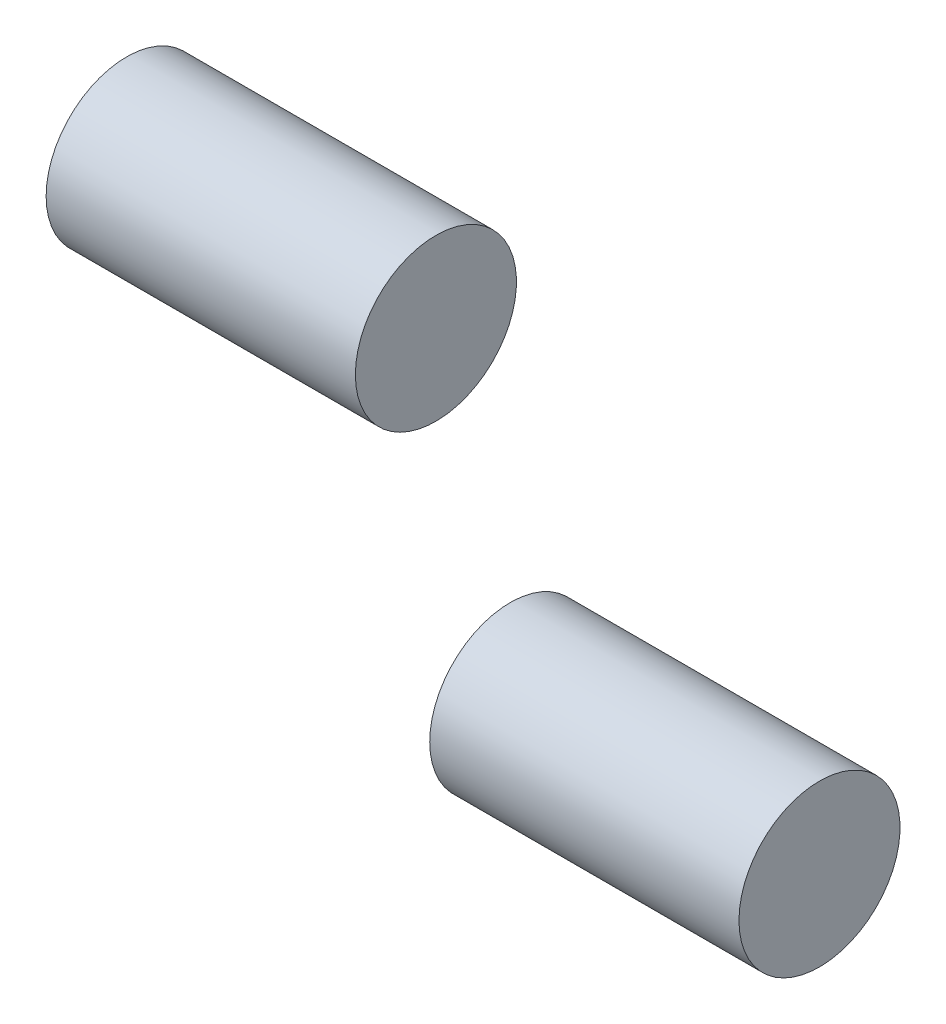
ISO-10303-21;
HEADER;
FILE_DESCRIPTION(('STEP AP214'),'2;1');
FILE_NAME('part.step','',(''),(''),'','','');
FILE_SCHEMA(('AUTOMOTIVE_DESIGN { 1 0 10303 214 1 1 1 1 }'));
ENDSEC;
DATA;
#1=APPLICATION_CONTEXT('core data for automotive mechanical design processes');
#2=APPLICATION_PROTOCOL_DEFINITION('international standard','automotive_design',2000,#1);
#3=PRODUCT_CONTEXT('',#1,'mechanical');
#4=PRODUCT('Part','Part','',(#3));
#5=PRODUCT_RELATED_PRODUCT_CATEGORY('part','',(#4));
#6=PRODUCT_DEFINITION_FORMATION('','',#4);
#7=PRODUCT_DEFINITION_CONTEXT('part definition',#1,'design');
#8=PRODUCT_DEFINITION('design','',#6,#7);
#9=PRODUCT_DEFINITION_SHAPE('','',#8);
#10=(LENGTH_UNIT() NAMED_UNIT(*) SI_UNIT(.MILLI.,.METRE.));
#11=(NAMED_UNIT(*) PLANE_ANGLE_UNIT() SI_UNIT($,.RADIAN.));
#12=(NAMED_UNIT(*) SI_UNIT($,.STERADIAN.) SOLID_ANGLE_UNIT());
#13=UNCERTAINTY_MEASURE_WITH_UNIT(LENGTH_MEASURE(1.E-05),#10,'distance_accuracy_value','');
#14=(GEOMETRIC_REPRESENTATION_CONTEXT(3) GLOBAL_UNCERTAINTY_ASSIGNED_CONTEXT((#13)) GLOBAL_UNIT_ASSIGNED_CONTEXT((#10,
#11,#12)) REPRESENTATION_CONTEXT('',''));
#15=CARTESIAN_POINT('',(0.,0.,0.));
#16=DIRECTION('',(0.,0.,1.));
#17=DIRECTION('',(1.,0.,0.));
#18=AXIS2_PLACEMENT_3D('',#15,#16,#17);
#19=CARTESIAN_POINT('',(9.94,5.49999999999999,2.27081684706087E-06));
#20=DIRECTION('',(1.,0.,0.));
#21=DIRECTION('',(0.,0.,-1.));
#22=AXIS2_PLACEMENT_3D('',#19,#20,#21);
#23=PLANE('',#22);
#24=CARTESIAN_POINT('',(9.94,5.5,0.));
#25=DIRECTION('',(-1.,0.,0.));
#26=DIRECTION('',(0.,0.,1.));
#27=AXIS2_PLACEMENT_3D('',#24,#25,#26);
#28=CIRCLE('',#27,1.);
#29=CARTESIAN_POINT('',(9.94,5.5,1.));
#30=VERTEX_POINT('',#29);
#31=EDGE_CURVE('P0_E17',#30,#30,#28,.T.);
#32=ORIENTED_EDGE('',*,*,#31,.F.);
#33=EDGE_LOOP('',(#32));
#34=FACE_BOUND('',#33,.T.);
#35=ADVANCED_FACE('P0_F14',(#34),#23,.T.);
#36=CARTESIAN_POINT('',(6.09999999999999,0.,0.));
#37=DIRECTION('',(-1.,0.,0.));
#38=DIRECTION('',(0.,0.,1.));
#39=AXIS2_PLACEMENT_3D('',#36,#37,#38);
#40=PLANE('',#39);
#41=CARTESIAN_POINT('',(6.09999999999999,5.5,0.));
#42=DIRECTION('',(-1.,0.,0.));
#43=DIRECTION('',(0.,0.,1.));
#44=AXIS2_PLACEMENT_3D('',#41,#42,#43);
#45=CIRCLE('',#44,1.);
#46=CARTESIAN_POINT('',(6.09999999999999,5.5,1.));
#47=VERTEX_POINT('',#46);
#48=EDGE_CURVE('P0_E10',#47,#47,#45,.F.);
#49=ORIENTED_EDGE('',*,*,#48,.F.);
#50=EDGE_LOOP('',(#49));
#51=FACE_BOUND('',#50,.T.);
#52=ADVANCED_FACE('P0_F29',(#51),#40,.T.);
#53=CARTESIAN_POINT('',(9.94,5.5,0.));
#54=DIRECTION('',(-1.,0.,0.));
#55=DIRECTION('',(0.,0.,1.));
#56=AXIS2_PLACEMENT_3D('',#53,#54,#55);
#57=CYLINDRICAL_SURFACE('',#56,1.);
#58=ORIENTED_EDGE('',*,*,#48,.T.);
#59=EDGE_LOOP('',(#58));
#60=FACE_BOUND('',#59,.T.);
#61=ORIENTED_EDGE('',*,*,#31,.T.);
#62=EDGE_LOOP('',(#61));
#63=FACE_BOUND('',#62,.T.);
#64=ADVANCED_FACE('P0_F26',(#60,#63),#57,.T.);
#65=CLOSED_SHELL('',(#35,#52,#64));
#66=MANIFOLD_SOLID_BREP('P0_B1',#65);
#67=CARTESIAN_POINT('',(9.93999999999999,-2.75,-4.763139720814));
#68=DIRECTION('',(1.,0.,0.));
#69=DIRECTION('',(0.,0.,-1.));
#70=AXIS2_PLACEMENT_3D('',#67,#68,#69);
#71=PLANE('',#70);
#72=CARTESIAN_POINT('',(9.93999999999999,-2.75,-4.763139720814));
#73=DIRECTION('',(-1.,0.,0.));
#74=DIRECTION('',(0.,0.,1.));
#75=AXIS2_PLACEMENT_3D('',#72,#73,#74);
#76=CIRCLE('',#75,1.);
#77=CARTESIAN_POINT('',(9.93999999999999,-2.75,-3.763139720814));
#78=VERTEX_POINT('',#77);
#79=EDGE_CURVE('P1_E17',#78,#78,#76,.T.);
#80=ORIENTED_EDGE('',*,*,#79,.F.);
#81=EDGE_LOOP('',(#80));
#82=FACE_BOUND('',#81,.T.);
#83=ADVANCED_FACE('P1_F14',(#82),#71,.T.);
#84=CARTESIAN_POINT('',(6.10000000000002,0.,0.));
#85=DIRECTION('',(-1.,0.,0.));
#86=DIRECTION('',(0.,-1.,0.));
#87=AXIS2_PLACEMENT_3D('',#84,#85,#86);
#88=PLANE('',#87);
#89=CARTESIAN_POINT('',(6.10000000000001,-2.75,-4.763139720814));
#90=DIRECTION('',(-1.,0.,0.));
#91=DIRECTION('',(0.,0.,1.));
#92=AXIS2_PLACEMENT_3D('',#89,#90,#91);
#93=CIRCLE('',#92,1.);
#94=CARTESIAN_POINT('',(6.10000000000001,-2.75,-3.763139720814));
#95=VERTEX_POINT('',#94);
#96=EDGE_CURVE('P1_E10',#95,#95,#93,.F.);
#97=ORIENTED_EDGE('',*,*,#96,.F.);
#98=EDGE_LOOP('',(#97));
#99=FACE_BOUND('',#98,.T.);
#100=ADVANCED_FACE('P1_F29',(#99),#88,.T.);
#101=CARTESIAN_POINT('',(9.93999999999999,-2.75,-4.763139720814));
#102=DIRECTION('',(-1.,0.,0.));
#103=DIRECTION('',(0.,0.,1.));
#104=AXIS2_PLACEMENT_3D('',#101,#102,#103);
#105=CYLINDRICAL_SURFACE('',#104,1.);
#106=ORIENTED_EDGE('',*,*,#96,.T.);
#107=EDGE_LOOP('',(#106));
#108=FACE_BOUND('',#107,.T.);
#109=ORIENTED_EDGE('',*,*,#79,.T.);
#110=EDGE_LOOP('',(#109));
#111=FACE_BOUND('',#110,.T.);
#112=ADVANCED_FACE('P1_F26',(#108,#111),#105,.T.);
#113=CLOSED_SHELL('',(#83,#100,#112));
#114=MANIFOLD_SOLID_BREP('P1_B1',#113);
#115=ADVANCED_BREP_SHAPE_REPRESENTATION('',(#18,#66,#114),#14);
#116=SHAPE_DEFINITION_REPRESENTATION(#9,#115);
ENDSEC;
END-ISO-10303-21;
